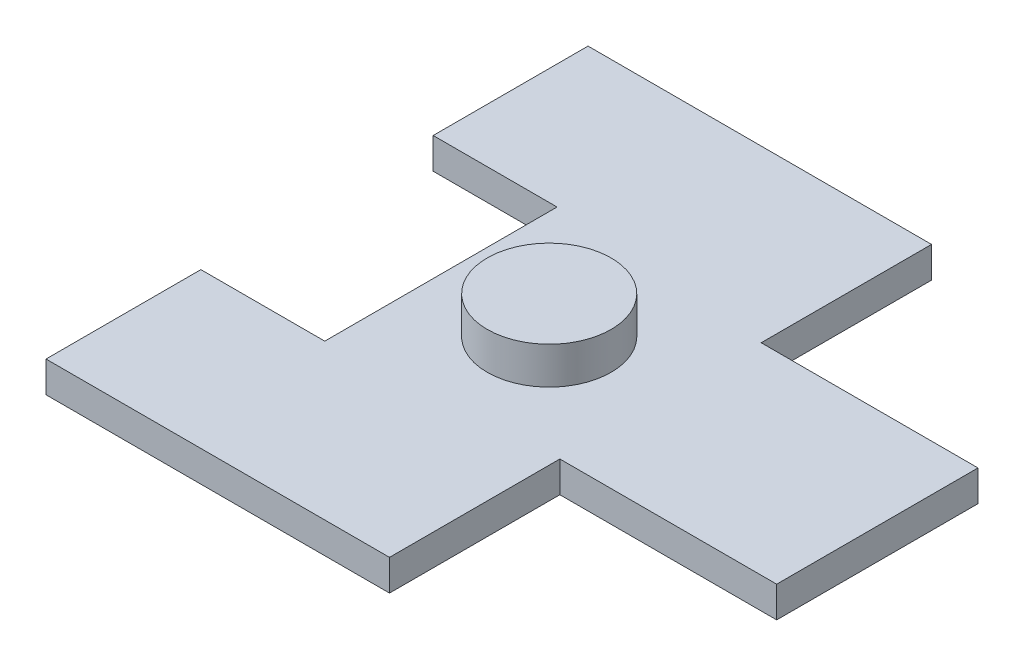
ISO-10303-21;
HEADER;
FILE_DESCRIPTION(('STEP AP214'),'2;1');
FILE_NAME('part.step','',(''),(''),'','','');
FILE_SCHEMA(('AUTOMOTIVE_DESIGN { 1 0 10303 214 1 1 1 1 }'));
ENDSEC;
DATA;
#1=APPLICATION_CONTEXT('core data for automotive mechanical design processes');
#2=APPLICATION_PROTOCOL_DEFINITION('international standard','automotive_design',2000,#1);
#3=PRODUCT_CONTEXT('',#1,'mechanical');
#4=PRODUCT('Part','Part','',(#3));
#5=PRODUCT_RELATED_PRODUCT_CATEGORY('part','',(#4));
#6=PRODUCT_DEFINITION_FORMATION('','',#4);
#7=PRODUCT_DEFINITION_CONTEXT('part definition',#1,'design');
#8=PRODUCT_DEFINITION('design','',#6,#7);
#9=PRODUCT_DEFINITION_SHAPE('','',#8);
#10=(LENGTH_UNIT() NAMED_UNIT(*) SI_UNIT(.MILLI.,.METRE.));
#11=(NAMED_UNIT(*) PLANE_ANGLE_UNIT() SI_UNIT($,.RADIAN.));
#12=(NAMED_UNIT(*) SI_UNIT($,.STERADIAN.) SOLID_ANGLE_UNIT());
#13=UNCERTAINTY_MEASURE_WITH_UNIT(LENGTH_MEASURE(1.E-05),#10,'distance_accuracy_value','');
#14=(GEOMETRIC_REPRESENTATION_CONTEXT(3) GLOBAL_UNCERTAINTY_ASSIGNED_CONTEXT((#13)) GLOBAL_UNIT_ASSIGNED_CONTEXT((#10,
#11,#12)) REPRESENTATION_CONTEXT('',''));
#15=CARTESIAN_POINT('',(0.,0.,0.));
#16=DIRECTION('',(0.,0.,1.));
#17=DIRECTION('',(1.,0.,0.));
#18=AXIS2_PLACEMENT_3D('',#15,#16,#17);
#19=CARTESIAN_POINT('',(-9.41679626749611,2.,-17.5));
#20=DIRECTION('',(0.,0.,1.));
#21=DIRECTION('',(1.,0.,0.));
#22=AXIS2_PLACEMENT_3D('',#19,#20,#21);
#23=PLANE('',#22);
#24=DIRECTION('',(-1.,0.,0.));
#25=VECTOR('',#24,1.);
#26=CARTESIAN_POINT('',(-9.41679626749611,0.,-17.5));
#27=LINE('',#26,#25);
#28=CARTESIAN_POINT('',(0.624790046656302,0.,-17.5));
#29=VERTEX_POINT('',#28);
#30=CARTESIAN_POINT('',(-21.5552099533437,0.,-17.5));
#31=VERTEX_POINT('',#30);
#32=EDGE_CURVE('E99',#29,#31,#27,.T.);
#33=ORIENTED_EDGE('',*,*,#32,.T.);
#34=DIRECTION('',(0.,-1.,0.));
#35=VECTOR('',#34,1.);
#36=CARTESIAN_POINT('',(-21.5552099533437,2.,-17.5));
#37=LINE('',#36,#35);
#38=CARTESIAN_POINT('',(-21.5552099533437,2.,-17.5));
#39=VERTEX_POINT('',#38);
#40=EDGE_CURVE('E11',#39,#31,#37,.T.);
#41=ORIENTED_EDGE('',*,*,#40,.F.);
#42=DIRECTION('',(-1.,0.,0.));
#43=VECTOR('',#42,1.);
#44=CARTESIAN_POINT('',(-9.41679626749611,2.,-17.5));
#45=LINE('',#44,#43);
#46=CARTESIAN_POINT('',(0.624790046656302,2.,-17.5));
#47=VERTEX_POINT('',#46);
#48=EDGE_CURVE('E105',#47,#39,#45,.T.);
#49=ORIENTED_EDGE('',*,*,#48,.F.);
#50=DIRECTION('',(0.,-1.,0.));
#51=VECTOR('',#50,1.);
#52=CARTESIAN_POINT('',(0.624790046656302,2.,-17.5));
#53=LINE('',#52,#51);
#54=EDGE_CURVE('E151',#47,#29,#53,.T.);
#55=ORIENTED_EDGE('',*,*,#54,.T.);
#56=EDGE_LOOP('',(#33,#41,#49,#55));
#57=FACE_BOUND('',#56,.T.);
#58=ADVANCED_FACE('F35',(#57),#23,.F.);
#59=CARTESIAN_POINT('',(-21.5552099533437,2.,-17.5));
#60=DIRECTION('',(1.,0.,0.));
#61=DIRECTION('',(0.,0.,-1.));
#62=AXIS2_PLACEMENT_3D('',#59,#60,#61);
#63=PLANE('',#62);
#64=DIRECTION('',(0.,0.,1.));
#65=VECTOR('',#64,1.);
#66=CARTESIAN_POINT('',(-21.5552099533437,0.,-17.5));
#67=LINE('',#66,#65);
#68=CARTESIAN_POINT('',(-21.5552099533437,0.,-7.50000000000001));
#69=VERTEX_POINT('',#68);
#70=EDGE_CURVE('E156',#31,#69,#67,.T.);
#71=ORIENTED_EDGE('',*,*,#70,.T.);
#72=DIRECTION('',(0.,-1.,0.));
#73=VECTOR('',#72,1.);
#74=CARTESIAN_POINT('',(-21.5552099533437,2.,-7.50000000000001));
#75=LINE('',#74,#73);
#76=CARTESIAN_POINT('',(-21.5552099533437,2.,-7.50000000000001));
#77=VERTEX_POINT('',#76);
#78=EDGE_CURVE('E43',#77,#69,#75,.T.);
#79=ORIENTED_EDGE('',*,*,#78,.F.);
#80=DIRECTION('',(0.,0.,1.));
#81=VECTOR('',#80,1.);
#82=CARTESIAN_POINT('',(-21.5552099533437,2.,-17.5));
#83=LINE('',#82,#81);
#84=EDGE_CURVE('E246',#39,#77,#83,.T.);
#85=ORIENTED_EDGE('',*,*,#84,.F.);
#86=ORIENTED_EDGE('',*,*,#40,.T.);
#87=EDGE_LOOP('',(#71,#79,#85,#86));
#88=FACE_BOUND('',#87,.T.);
#89=ADVANCED_FACE('F252',(#88),#63,.F.);
#90=CARTESIAN_POINT('',(-13.5552099533437,2.,-7.50000000000001));
#91=DIRECTION('',(0.,0.,-1.));
#92=DIRECTION('',(-1.,0.,0.));
#93=AXIS2_PLACEMENT_3D('',#90,#91,#92);
#94=PLANE('',#93);
#95=DIRECTION('',(1.,0.,0.));
#96=VECTOR('',#95,1.);
#97=CARTESIAN_POINT('',(-13.5552099533437,0.,-7.50000000000001));
#98=LINE('',#97,#96);
#99=CARTESIAN_POINT('',(-13.5552099533437,0.,-7.50000000000001));
#100=VERTEX_POINT('',#99);
#101=EDGE_CURVE('E159',#69,#100,#98,.T.);
#102=ORIENTED_EDGE('',*,*,#101,.T.);
#103=DIRECTION('',(0.,-1.,0.));
#104=VECTOR('',#103,1.);
#105=CARTESIAN_POINT('',(-13.5552099533437,2.,-7.50000000000001));
#106=LINE('',#105,#104);
#107=CARTESIAN_POINT('',(-13.5552099533437,2.,-7.50000000000001));
#108=VERTEX_POINT('',#107);
#109=EDGE_CURVE('E197',#108,#100,#106,.T.);
#110=ORIENTED_EDGE('',*,*,#109,.F.);
#111=DIRECTION('',(1.,0.,0.));
#112=VECTOR('',#111,1.);
#113=CARTESIAN_POINT('',(-13.5552099533437,2.,-7.50000000000001));
#114=LINE('',#113,#112);
#115=EDGE_CURVE('E206',#77,#108,#114,.T.);
#116=ORIENTED_EDGE('',*,*,#115,.F.);
#117=ORIENTED_EDGE('',*,*,#78,.T.);
#118=EDGE_LOOP('',(#102,#110,#116,#117));
#119=FACE_BOUND('',#118,.T.);
#120=ADVANCED_FACE('F204',(#119),#94,.F.);
#121=CARTESIAN_POINT('',(-13.5552099533437,2.,7.5));
#122=DIRECTION('',(1.,0.,0.));
#123=DIRECTION('',(0.,0.,-1.));
#124=AXIS2_PLACEMENT_3D('',#121,#122,#123);
#125=PLANE('',#124);
#126=DIRECTION('',(0.,0.,1.));
#127=VECTOR('',#126,1.);
#128=CARTESIAN_POINT('',(-13.5552099533437,0.,7.5));
#129=LINE('',#128,#127);
#130=CARTESIAN_POINT('',(-13.5552099533437,0.,7.5));
#131=VERTEX_POINT('',#130);
#132=EDGE_CURVE('E161',#100,#131,#129,.T.);
#133=ORIENTED_EDGE('',*,*,#132,.T.);
#134=DIRECTION('',(0.,-1.,0.));
#135=VECTOR('',#134,1.);
#136=CARTESIAN_POINT('',(-13.5552099533437,2.,7.5));
#137=LINE('',#136,#135);
#138=CARTESIAN_POINT('',(-13.5552099533437,2.,7.5));
#139=VERTEX_POINT('',#138);
#140=EDGE_CURVE('E194',#139,#131,#137,.T.);
#141=ORIENTED_EDGE('',*,*,#140,.F.);
#142=DIRECTION('',(0.,0.,1.));
#143=VECTOR('',#142,1.);
#144=CARTESIAN_POINT('',(-13.5552099533437,2.,7.5));
#145=LINE('',#144,#143);
#146=EDGE_CURVE('E224',#108,#139,#145,.T.);
#147=ORIENTED_EDGE('',*,*,#146,.F.);
#148=ORIENTED_EDGE('',*,*,#109,.T.);
#149=EDGE_LOOP('',(#133,#141,#147,#148));
#150=FACE_BOUND('',#149,.T.);
#151=ADVANCED_FACE('F215',(#150),#125,.F.);
#152=CARTESIAN_POINT('',(-13.5552099533437,2.,7.5));
#153=DIRECTION('',(0.,0.,1.));
#154=DIRECTION('',(1.,0.,0.));
#155=AXIS2_PLACEMENT_3D('',#152,#153,#154);
#156=PLANE('',#155);
#157=DIRECTION('',(-1.,0.,0.));
#158=VECTOR('',#157,1.);
#159=CARTESIAN_POINT('',(-13.5552099533437,0.,7.5));
#160=LINE('',#159,#158);
#161=CARTESIAN_POINT('',(-21.5552099533437,0.,7.5));
#162=VERTEX_POINT('',#161);
#163=EDGE_CURVE('E163',#131,#162,#160,.T.);
#164=ORIENTED_EDGE('',*,*,#163,.T.);
#165=DIRECTION('',(0.,-1.,0.));
#166=VECTOR('',#165,1.);
#167=CARTESIAN_POINT('',(-21.5552099533437,2.,7.5));
#168=LINE('',#167,#166);
#169=CARTESIAN_POINT('',(-21.5552099533437,2.,7.5));
#170=VERTEX_POINT('',#169);
#171=EDGE_CURVE('E191',#170,#162,#168,.T.);
#172=ORIENTED_EDGE('',*,*,#171,.F.);
#173=DIRECTION('',(-1.,0.,0.));
#174=VECTOR('',#173,1.);
#175=CARTESIAN_POINT('',(-13.5552099533437,2.,7.5));
#176=LINE('',#175,#174);
#177=EDGE_CURVE('E221',#139,#170,#176,.T.);
#178=ORIENTED_EDGE('',*,*,#177,.F.);
#179=ORIENTED_EDGE('',*,*,#140,.T.);
#180=EDGE_LOOP('',(#164,#172,#178,#179));
#181=FACE_BOUND('',#180,.T.);
#182=ADVANCED_FACE('F219',(#181),#156,.F.);
#183=CARTESIAN_POINT('',(-21.5552099533437,2.,17.5));
#184=DIRECTION('',(1.,0.,0.));
#185=DIRECTION('',(0.,0.,-1.));
#186=AXIS2_PLACEMENT_3D('',#183,#184,#185);
#187=PLANE('',#186);
#188=DIRECTION('',(0.,0.,1.));
#189=VECTOR('',#188,1.);
#190=CARTESIAN_POINT('',(-21.5552099533437,0.,17.5));
#191=LINE('',#190,#189);
#192=CARTESIAN_POINT('',(-21.5552099533437,0.,17.5));
#193=VERTEX_POINT('',#192);
#194=EDGE_CURVE('E165',#162,#193,#191,.T.);
#195=ORIENTED_EDGE('',*,*,#194,.T.);
#196=DIRECTION('',(0.,-1.,0.));
#197=VECTOR('',#196,1.);
#198=CARTESIAN_POINT('',(-21.5552099533437,2.,17.5));
#199=LINE('',#198,#197);
#200=CARTESIAN_POINT('',(-21.5552099533437,2.,17.5));
#201=VERTEX_POINT('',#200);
#202=EDGE_CURVE('E188',#201,#193,#199,.T.);
#203=ORIENTED_EDGE('',*,*,#202,.F.);
#204=DIRECTION('',(0.,0.,1.));
#205=VECTOR('',#204,1.);
#206=CARTESIAN_POINT('',(-21.5552099533437,2.,17.5));
#207=LINE('',#206,#205);
#208=EDGE_CURVE('E223',#170,#201,#207,.T.);
#209=ORIENTED_EDGE('',*,*,#208,.F.);
#210=ORIENTED_EDGE('',*,*,#171,.T.);
#211=EDGE_LOOP('',(#195,#203,#209,#210));
#212=FACE_BOUND('',#211,.T.);
#213=ADVANCED_FACE('F264',(#212),#187,.F.);
#214=CARTESIAN_POINT('',(-9.41679626749611,2.,17.5));
#215=DIRECTION('',(0.,0.,-1.));
#216=DIRECTION('',(-1.,0.,0.));
#217=AXIS2_PLACEMENT_3D('',#214,#215,#216);
#218=PLANE('',#217);
#219=DIRECTION('',(1.,0.,0.));
#220=VECTOR('',#219,1.);
#221=CARTESIAN_POINT('',(-9.41679626749611,0.,17.5));
#222=LINE('',#221,#220);
#223=CARTESIAN_POINT('',(0.624790046656302,0.,17.5));
#224=VERTEX_POINT('',#223);
#225=EDGE_CURVE('E168',#193,#224,#222,.T.);
#226=ORIENTED_EDGE('',*,*,#225,.T.);
#227=DIRECTION('',(0.,-1.,0.));
#228=VECTOR('',#227,1.);
#229=CARTESIAN_POINT('',(0.624790046656302,2.,17.5));
#230=LINE('',#229,#228);
#231=CARTESIAN_POINT('',(0.624790046656302,2.,17.5));
#232=VERTEX_POINT('',#231);
#233=EDGE_CURVE('E185',#232,#224,#230,.T.);
#234=ORIENTED_EDGE('',*,*,#233,.F.);
#235=DIRECTION('',(1.,0.,0.));
#236=VECTOR('',#235,1.);
#237=CARTESIAN_POINT('',(-9.41679626749611,2.,17.5));
#238=LINE('',#237,#236);
#239=EDGE_CURVE('E226',#201,#232,#238,.T.);
#240=ORIENTED_EDGE('',*,*,#239,.F.);
#241=ORIENTED_EDGE('',*,*,#202,.T.);
#242=EDGE_LOOP('',(#226,#234,#240,#241));
#243=FACE_BOUND('',#242,.T.);
#244=ADVANCED_FACE('F267',(#243),#218,.F.);
#245=CARTESIAN_POINT('',(0.624790046656302,2.,17.5));
#246=DIRECTION('',(-1.,0.,0.));
#247=DIRECTION('',(0.,0.,1.));
#248=AXIS2_PLACEMENT_3D('',#245,#246,#247);
#249=PLANE('',#248);
#250=DIRECTION('',(0.,0.,-1.));
#251=VECTOR('',#250,1.);
#252=CARTESIAN_POINT('',(0.624790046656302,0.,17.5));
#253=LINE('',#252,#251);
#254=CARTESIAN_POINT('',(0.624790046656302,0.,6.5));
#255=VERTEX_POINT('',#254);
#256=EDGE_CURVE('E170',#224,#255,#253,.T.);
#257=ORIENTED_EDGE('',*,*,#256,.T.);
#258=DIRECTION('',(0.,-1.,0.));
#259=VECTOR('',#258,1.);
#260=CARTESIAN_POINT('',(0.624790046656302,2.,6.5));
#261=LINE('',#260,#259);
#262=CARTESIAN_POINT('',(0.624790046656302,2.,6.5));
#263=VERTEX_POINT('',#262);
#264=EDGE_CURVE('E182',#263,#255,#261,.T.);
#265=ORIENTED_EDGE('',*,*,#264,.F.);
#266=DIRECTION('',(0.,0.,-1.));
#267=VECTOR('',#266,1.);
#268=CARTESIAN_POINT('',(0.624790046656302,2.,17.5));
#269=LINE('',#268,#267);
#270=EDGE_CURVE('E232',#232,#263,#269,.T.);
#271=ORIENTED_EDGE('',*,*,#270,.F.);
#272=ORIENTED_EDGE('',*,*,#233,.T.);
#273=EDGE_LOOP('',(#257,#265,#271,#272));
#274=FACE_BOUND('',#273,.T.);
#275=ADVANCED_FACE('F238',(#274),#249,.F.);
#276=CARTESIAN_POINT('',(0.624790046656302,2.,6.5));
#277=DIRECTION('',(0.,0.,-1.));
#278=DIRECTION('',(-1.,0.,0.));
#279=AXIS2_PLACEMENT_3D('',#276,#277,#278);
#280=PLANE('',#279);
#281=DIRECTION('',(1.,0.,0.));
#282=VECTOR('',#281,1.);
#283=CARTESIAN_POINT('',(0.624790046656302,0.,6.5));
#284=LINE('',#283,#282);
#285=CARTESIAN_POINT('',(14.6247900466563,0.,6.5));
#286=VERTEX_POINT('',#285);
#287=EDGE_CURVE('E172',#255,#286,#284,.T.);
#288=ORIENTED_EDGE('',*,*,#287,.T.);
#289=DIRECTION('',(0.,-1.,0.));
#290=VECTOR('',#289,1.);
#291=CARTESIAN_POINT('',(14.6247900466563,2.,6.5));
#292=LINE('',#291,#290);
#293=CARTESIAN_POINT('',(14.6247900466563,2.,6.5));
#294=VERTEX_POINT('',#293);
#295=EDGE_CURVE('E146',#294,#286,#292,.T.);
#296=ORIENTED_EDGE('',*,*,#295,.F.);
#297=DIRECTION('',(1.,0.,0.));
#298=VECTOR('',#297,1.);
#299=CARTESIAN_POINT('',(0.624790046656302,2.,6.5));
#300=LINE('',#299,#298);
#301=EDGE_CURVE('E137',#263,#294,#300,.T.);
#302=ORIENTED_EDGE('',*,*,#301,.F.);
#303=ORIENTED_EDGE('',*,*,#264,.T.);
#304=EDGE_LOOP('',(#288,#296,#302,#303));
#305=FACE_BOUND('',#304,.T.);
#306=ADVANCED_FACE('F242',(#305),#280,.F.);
#307=CARTESIAN_POINT('',(14.6247900466563,2.,-6.50000000000001));
#308=DIRECTION('',(-1.,0.,0.));
#309=DIRECTION('',(0.,0.,1.));
#310=AXIS2_PLACEMENT_3D('',#307,#308,#309);
#311=PLANE('',#310);
#312=DIRECTION('',(0.,0.,-1.));
#313=VECTOR('',#312,1.);
#314=CARTESIAN_POINT('',(14.6247900466563,0.,-6.50000000000001));
#315=LINE('',#314,#313);
#316=CARTESIAN_POINT('',(14.6247900466563,0.,-6.50000000000001));
#317=VERTEX_POINT('',#316);
#318=EDGE_CURVE('E145',#286,#317,#315,.T.);
#319=ORIENTED_EDGE('',*,*,#318,.T.);
#320=DIRECTION('',(0.,-1.,0.));
#321=VECTOR('',#320,1.);
#322=CARTESIAN_POINT('',(14.6247900466563,2.,-6.50000000000001));
#323=LINE('',#322,#321);
#324=CARTESIAN_POINT('',(14.6247900466563,2.,-6.50000000000001));
#325=VERTEX_POINT('',#324);
#326=EDGE_CURVE('E142',#325,#317,#323,.T.);
#327=ORIENTED_EDGE('',*,*,#326,.F.);
#328=DIRECTION('',(0.,0.,-1.));
#329=VECTOR('',#328,1.);
#330=CARTESIAN_POINT('',(14.6247900466563,2.,-6.50000000000001));
#331=LINE('',#330,#329);
#332=EDGE_CURVE('E131',#294,#325,#331,.T.);
#333=ORIENTED_EDGE('',*,*,#332,.F.);
#334=ORIENTED_EDGE('',*,*,#295,.T.);
#335=EDGE_LOOP('',(#319,#327,#333,#334));
#336=FACE_BOUND('',#335,.T.);
#337=ADVANCED_FACE('F143',(#336),#311,.F.);
#338=CARTESIAN_POINT('',(0.624790046656302,2.,-6.50000000000001));
#339=DIRECTION('',(0.,0.,1.));
#340=DIRECTION('',(1.,0.,0.));
#341=AXIS2_PLACEMENT_3D('',#338,#339,#340);
#342=PLANE('',#341);
#343=DIRECTION('',(-1.,0.,0.));
#344=VECTOR('',#343,1.);
#345=CARTESIAN_POINT('',(0.624790046656302,0.,-6.50000000000001));
#346=LINE('',#345,#344);
#347=CARTESIAN_POINT('',(0.624790046656302,0.,-6.50000000000001));
#348=VERTEX_POINT('',#347);
#349=EDGE_CURVE('E92',#317,#348,#346,.T.);
#350=ORIENTED_EDGE('',*,*,#349,.T.);
#351=DIRECTION('',(0.,-1.,0.));
#352=VECTOR('',#351,1.);
#353=CARTESIAN_POINT('',(0.624790046656302,2.,-6.50000000000001));
#354=LINE('',#353,#352);
#355=CARTESIAN_POINT('',(0.624790046656302,2.,-6.50000000000001));
#356=VERTEX_POINT('',#355);
#357=EDGE_CURVE('E147',#356,#348,#354,.T.);
#358=ORIENTED_EDGE('',*,*,#357,.F.);
#359=DIRECTION('',(-1.,0.,0.));
#360=VECTOR('',#359,1.);
#361=CARTESIAN_POINT('',(0.624790046656302,2.,-6.50000000000001));
#362=LINE('',#361,#360);
#363=EDGE_CURVE('E135',#325,#356,#362,.T.);
#364=ORIENTED_EDGE('',*,*,#363,.F.);
#365=ORIENTED_EDGE('',*,*,#326,.T.);
#366=EDGE_LOOP('',(#350,#358,#364,#365));
#367=FACE_BOUND('',#366,.T.);
#368=ADVANCED_FACE('F149',(#367),#342,.F.);
#369=CARTESIAN_POINT('',(0.624790046656302,2.,-6.50000000000001));
#370=DIRECTION('',(-1.,0.,0.));
#371=DIRECTION('',(0.,0.,1.));
#372=AXIS2_PLACEMENT_3D('',#369,#370,#371);
#373=PLANE('',#372);
#374=DIRECTION('',(0.,0.,-1.));
#375=VECTOR('',#374,1.);
#376=CARTESIAN_POINT('',(0.624790046656302,0.,-6.50000000000001));
#377=LINE('',#376,#375);
#378=EDGE_CURVE('E176',#348,#29,#377,.T.);
#379=ORIENTED_EDGE('',*,*,#378,.T.);
#380=ORIENTED_EDGE('',*,*,#54,.F.);
#381=DIRECTION('',(0.,0.,-1.));
#382=VECTOR('',#381,1.);
#383=CARTESIAN_POINT('',(0.624790046656302,2.,-6.50000000000001));
#384=LINE('',#383,#382);
#385=EDGE_CURVE('E51',#356,#47,#384,.T.);
#386=ORIENTED_EDGE('',*,*,#385,.F.);
#387=ORIENTED_EDGE('',*,*,#357,.T.);
#388=EDGE_LOOP('',(#379,#380,#386,#387));
#389=FACE_BOUND('',#388,.T.);
#390=ADVANCED_FACE('F244',(#389),#373,.F.);
#391=CARTESIAN_POINT('',(0.,2.,0.));
#392=DIRECTION('',(0.,1.,0.));
#393=DIRECTION('',(0.,0.,1.));
#394=AXIS2_PLACEMENT_3D('',#391,#392,#393);
#395=PLANE('',#394);
#396=CARTESIAN_POINT('',(-6.5639099533437,2.,0.));
#397=DIRECTION('',(0.,1.,0.));
#398=DIRECTION('',(0.,0.,1.));
#399=AXIS2_PLACEMENT_3D('',#396,#397,#398);
#400=CIRCLE('',#399,4.);
#401=CARTESIAN_POINT('',(-6.5639099533437,2.,4.));
#402=VERTEX_POINT('',#401);
#403=EDGE_CURVE('E250',#402,#402,#400,.T.);
#404=ORIENTED_EDGE('',*,*,#403,.F.);
#405=EDGE_LOOP('',(#404));
#406=FACE_BOUND('',#405,.T.);
#407=ORIENTED_EDGE('',*,*,#48,.T.);
#408=ORIENTED_EDGE('',*,*,#84,.T.);
#409=ORIENTED_EDGE('',*,*,#115,.T.);
#410=ORIENTED_EDGE('',*,*,#146,.T.);
#411=ORIENTED_EDGE('',*,*,#177,.T.);
#412=ORIENTED_EDGE('',*,*,#208,.T.);
#413=ORIENTED_EDGE('',*,*,#239,.T.);
#414=ORIENTED_EDGE('',*,*,#270,.T.);
#415=ORIENTED_EDGE('',*,*,#301,.T.);
#416=ORIENTED_EDGE('',*,*,#332,.T.);
#417=ORIENTED_EDGE('',*,*,#363,.T.);
#418=ORIENTED_EDGE('',*,*,#385,.T.);
#419=EDGE_LOOP('',(#407,#408,#409,#410,#411,#412,#413,#414,#415,#416,#417,#418));
#420=FACE_BOUND('',#419,.T.);
#421=ADVANCED_FACE('F133',(#406,#420),#395,.T.);
#422=CARTESIAN_POINT('',(0.,0.,0.));
#423=DIRECTION('',(0.,1.,0.));
#424=DIRECTION('',(0.,0.,1.));
#425=AXIS2_PLACEMENT_3D('',#422,#423,#424);
#426=PLANE('',#425);
#427=ORIENTED_EDGE('',*,*,#32,.F.);
#428=ORIENTED_EDGE('',*,*,#378,.F.);
#429=ORIENTED_EDGE('',*,*,#349,.F.);
#430=ORIENTED_EDGE('',*,*,#318,.F.);
#431=ORIENTED_EDGE('',*,*,#287,.F.);
#432=ORIENTED_EDGE('',*,*,#256,.F.);
#433=ORIENTED_EDGE('',*,*,#225,.F.);
#434=ORIENTED_EDGE('',*,*,#194,.F.);
#435=ORIENTED_EDGE('',*,*,#163,.F.);
#436=ORIENTED_EDGE('',*,*,#132,.F.);
#437=ORIENTED_EDGE('',*,*,#101,.F.);
#438=ORIENTED_EDGE('',*,*,#70,.F.);
#439=EDGE_LOOP('',(#427,#428,#429,#430,#431,#432,#433,#434,#435,#436,#437,#438));
#440=FACE_BOUND('',#439,.T.);
#441=ADVANCED_FACE('F210',(#440),#426,.F.);
#442=CARTESIAN_POINT('',(-6.5639099533437,4.4,0.));
#443=DIRECTION('',(0.,-1.,0.));
#444=DIRECTION('',(0.,0.,-1.));
#445=AXIS2_PLACEMENT_3D('',#442,#443,#444);
#446=CYLINDRICAL_SURFACE('',#445,4.);
#447=CARTESIAN_POINT('',(-6.5639099533437,4.4,0.));
#448=DIRECTION('',(0.,1.,0.));
#449=DIRECTION('',(0.,0.,1.));
#450=AXIS2_PLACEMENT_3D('',#447,#448,#449);
#451=CIRCLE('',#450,4.);
#452=CARTESIAN_POINT('',(-6.5639099533437,4.4,4.));
#453=VERTEX_POINT('',#452);
#454=EDGE_CURVE('E157',#453,#453,#451,.T.);
#455=ORIENTED_EDGE('',*,*,#454,.F.);
#456=EDGE_LOOP('',(#455));
#457=FACE_BOUND('',#456,.T.);
#458=ORIENTED_EDGE('',*,*,#403,.T.);
#459=EDGE_LOOP('',(#458));
#460=FACE_BOUND('',#459,.T.);
#461=ADVANCED_FACE('F284',(#457,#460),#446,.T.);
#462=CARTESIAN_POINT('',(-6.5639099533437,4.4,0.));
#463=DIRECTION('',(0.,1.,0.));
#464=DIRECTION('',(0.,0.,1.));
#465=AXIS2_PLACEMENT_3D('',#462,#463,#464);
#466=PLANE('',#465);
#467=ORIENTED_EDGE('',*,*,#454,.T.);
#468=EDGE_LOOP('',(#467));
#469=FACE_BOUND('',#468,.T.);
#470=ADVANCED_FACE('F290',(#469),#466,.T.);
#471=CLOSED_SHELL('',(#58,#89,#120,#151,#182,#213,#244,#275,#306,#337,#368,#390,#421,#441,#461,#470));
#472=MANIFOLD_SOLID_BREP('B2',#471);
#473=ADVANCED_BREP_SHAPE_REPRESENTATION('',(#18,#472),#14);
#474=SHAPE_DEFINITION_REPRESENTATION(#9,#473);
ENDSEC;
END-ISO-10303-21;
